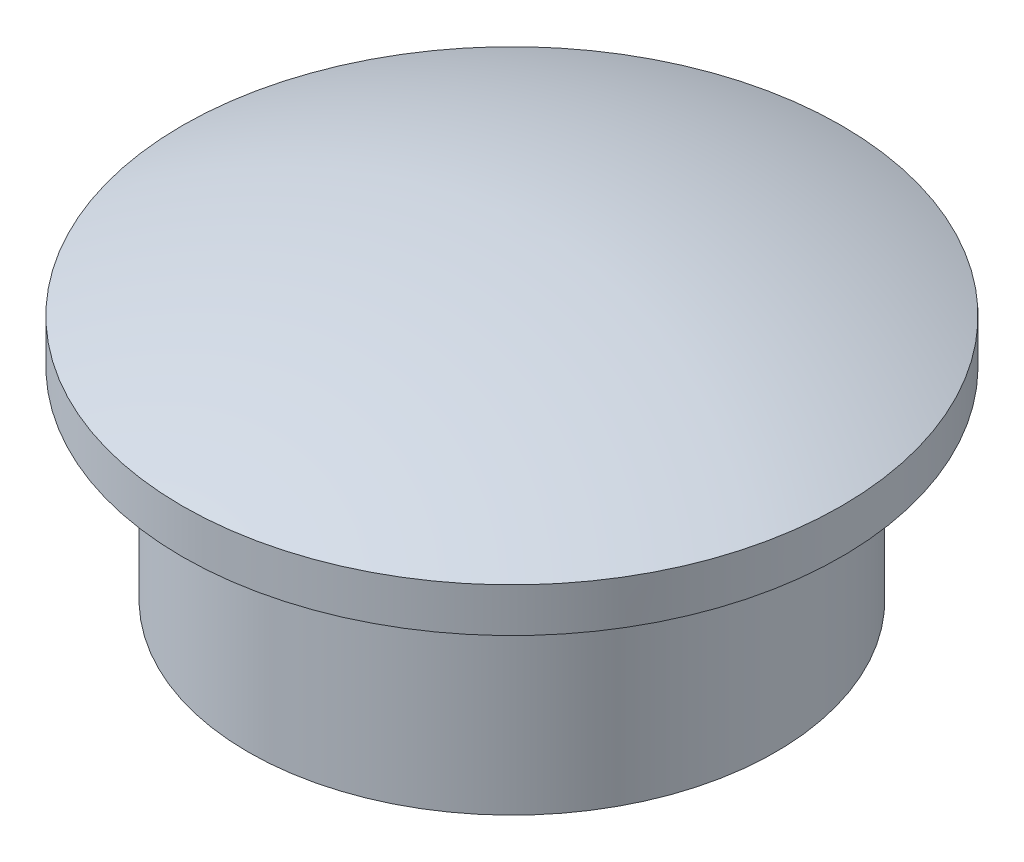
ISO-10303-21;
HEADER;
FILE_DESCRIPTION(('STEP AP214'),'2;1');
FILE_NAME('part.step','',(''),(''),'','','');
FILE_SCHEMA(('AUTOMOTIVE_DESIGN { 1 0 10303 214 1 1 1 1 }'));
ENDSEC;
DATA;
#1=APPLICATION_CONTEXT('core data for automotive mechanical design processes');
#2=APPLICATION_PROTOCOL_DEFINITION('international standard','automotive_design',2000,#1);
#3=PRODUCT_CONTEXT('',#1,'mechanical');
#4=PRODUCT('Part','Part','',(#3));
#5=PRODUCT_RELATED_PRODUCT_CATEGORY('part','',(#4));
#6=PRODUCT_DEFINITION_FORMATION('','',#4);
#7=PRODUCT_DEFINITION_CONTEXT('part definition',#1,'design');
#8=PRODUCT_DEFINITION('design','',#6,#7);
#9=PRODUCT_DEFINITION_SHAPE('','',#8);
#10=(LENGTH_UNIT() NAMED_UNIT(*) SI_UNIT(.MILLI.,.METRE.));
#11=(NAMED_UNIT(*) PLANE_ANGLE_UNIT() SI_UNIT($,.RADIAN.));
#12=(NAMED_UNIT(*) SI_UNIT($,.STERADIAN.) SOLID_ANGLE_UNIT());
#13=UNCERTAINTY_MEASURE_WITH_UNIT(LENGTH_MEASURE(1.E-05),#10,'distance_accuracy_value','');
#14=(GEOMETRIC_REPRESENTATION_CONTEXT(3) GLOBAL_UNCERTAINTY_ASSIGNED_CONTEXT((#13)) GLOBAL_UNIT_ASSIGNED_CONTEXT((#10,
#11,#12)) REPRESENTATION_CONTEXT('',''));
#15=CARTESIAN_POINT('',(0.,0.,0.));
#16=DIRECTION('',(0.,0.,1.));
#17=DIRECTION('',(1.,0.,0.));
#18=AXIS2_PLACEMENT_3D('',#15,#16,#17);
#19=CARTESIAN_POINT('',(0.,1.,0.));
#20=DIRECTION('',(0.,-1.,0.));
#21=DIRECTION('',(0.,0.,-1.));
#22=AXIS2_PLACEMENT_3D('',#19,#20,#21);
#23=CYLINDRICAL_SURFACE('',#22,7.5);
#24=CARTESIAN_POINT('',(0.,1.,0.));
#25=DIRECTION('',(0.,1.,0.));
#26=DIRECTION('',(0.,0.,1.));
#27=AXIS2_PLACEMENT_3D('',#24,#25,#26);
#28=CIRCLE('',#27,7.5);
#29=CARTESIAN_POINT('',(0.,1.,7.5));
#30=VERTEX_POINT('',#29);
#31=EDGE_CURVE('E44',#30,#30,#28,.T.);
#32=ORIENTED_EDGE('',*,*,#31,.F.);
#33=EDGE_LOOP('',(#32));
#34=FACE_BOUND('',#33,.T.);
#35=CARTESIAN_POINT('',(0.,0.,0.));
#36=DIRECTION('',(0.,1.,0.));
#37=DIRECTION('',(0.,0.,1.));
#38=AXIS2_PLACEMENT_3D('',#35,#36,#37);
#39=CIRCLE('',#38,7.5);
#40=CARTESIAN_POINT('',(0.,0.,7.5));
#41=VERTEX_POINT('',#40);
#42=EDGE_CURVE('E40',#41,#41,#39,.T.);
#43=ORIENTED_EDGE('',*,*,#42,.T.);
#44=EDGE_LOOP('',(#43));
#45=FACE_BOUND('',#44,.T.);
#46=ADVANCED_FACE('F37',(#34,#45),#23,.T.);
#47=CARTESIAN_POINT('',(0.,0.,0.));
#48=DIRECTION('',(0.,1.,0.));
#49=DIRECTION('',(0.,0.,1.));
#50=AXIS2_PLACEMENT_3D('',#47,#48,#49);
#51=PLANE('',#50);
#52=CARTESIAN_POINT('',(0.,0.,0.));
#53=DIRECTION('',(0.,-1.,0.));
#54=DIRECTION('',(0.,0.,-1.));
#55=AXIS2_PLACEMENT_3D('',#52,#53,#54);
#56=CIRCLE('',#55,6.);
#57=CARTESIAN_POINT('',(0.,0.,-6.));
#58=VERTEX_POINT('',#57);
#59=EDGE_CURVE('E10',#58,#58,#56,.T.);
#60=ORIENTED_EDGE('',*,*,#59,.F.);
#61=EDGE_LOOP('',(#60));
#62=FACE_BOUND('',#61,.T.);
#63=ORIENTED_EDGE('',*,*,#42,.F.);
#64=EDGE_LOOP('',(#63));
#65=FACE_BOUND('',#64,.T.);
#66=ADVANCED_FACE('F81',(#62,#65),#51,.F.);
#67=CARTESIAN_POINT('',(0.,-16.3701612903226,0.));
#68=DIRECTION('',(0.,1.,0.));
#69=DIRECTION('',(-1.,0.,0.));
#70=AXIS2_PLACEMENT_3D('',#67,#68,#69);
#71=SPHERICAL_SURFACE('',#70,18.9201612903226);
#72=ORIENTED_EDGE('',*,*,#31,.T.);
#73=EDGE_LOOP('',(#72));
#74=FACE_BOUND('',#73,.T.);
#75=ADVANCED_FACE('F76',(#74),#71,.T.);
#76=CARTESIAN_POINT('',(0.,-4.6,0.));
#77=DIRECTION('',(0.,1.,0.));
#78=DIRECTION('',(0.,0.,1.));
#79=AXIS2_PLACEMENT_3D('',#76,#77,#78);
#80=CYLINDRICAL_SURFACE('',#79,6.);
#81=CARTESIAN_POINT('',(0.,-4.6,0.));
#82=DIRECTION('',(0.,-1.,0.));
#83=DIRECTION('',(0.,0.,-1.));
#84=AXIS2_PLACEMENT_3D('',#81,#82,#83);
#85=CIRCLE('',#84,6.);
#86=CARTESIAN_POINT('',(0.,-4.6,-6.));
#87=VERTEX_POINT('',#86);
#88=EDGE_CURVE('E50',#87,#87,#85,.T.);
#89=ORIENTED_EDGE('',*,*,#88,.F.);
#90=EDGE_LOOP('',(#89));
#91=FACE_BOUND('',#90,.T.);
#92=ORIENTED_EDGE('',*,*,#59,.T.);
#93=EDGE_LOOP('',(#92));
#94=FACE_BOUND('',#93,.T.);
#95=ADVANCED_FACE('F71',(#91,#94),#80,.T.);
#96=CARTESIAN_POINT('',(0.,-4.6,0.));
#97=DIRECTION('',(0.,-1.,0.));
#98=DIRECTION('',(0.,0.,-1.));
#99=AXIS2_PLACEMENT_3D('',#96,#97,#98);
#100=PLANE('',#99);
#101=CARTESIAN_POINT('',(0.,-4.6,0.));
#102=DIRECTION('',(0.,-1.,0.));
#103=DIRECTION('',(0.,0.,-1.));
#104=AXIS2_PLACEMENT_3D('',#101,#102,#103);
#105=CIRCLE('',#104,4.95);
#106=CARTESIAN_POINT('',(0.,-4.6,-4.95));
#107=VERTEX_POINT('',#106);
#108=EDGE_CURVE('E54',#107,#107,#105,.T.);
#109=ORIENTED_EDGE('',*,*,#108,.F.);
#110=EDGE_LOOP('',(#109));
#111=FACE_BOUND('',#110,.T.);
#112=ORIENTED_EDGE('',*,*,#88,.T.);
#113=EDGE_LOOP('',(#112));
#114=FACE_BOUND('',#113,.T.);
#115=ADVANCED_FACE('F65',(#111,#114),#100,.T.);
#116=CARTESIAN_POINT('',(0.,1.,0.));
#117=DIRECTION('',(0.,-1.,0.));
#118=DIRECTION('',(0.,0.,-1.));
#119=AXIS2_PLACEMENT_3D('',#116,#117,#118);
#120=CYLINDRICAL_SURFACE('',#119,4.95);
#121=CARTESIAN_POINT('',(0.,1.,0.));
#122=DIRECTION('',(0.,-1.,0.));
#123=DIRECTION('',(0.,0.,-1.));
#124=AXIS2_PLACEMENT_3D('',#121,#122,#123);
#125=CIRCLE('',#124,4.95);
#126=CARTESIAN_POINT('',(0.,1.,-4.95));
#127=VERTEX_POINT('',#126);
#128=EDGE_CURVE('E53',#127,#127,#125,.T.);
#129=ORIENTED_EDGE('',*,*,#128,.F.);
#130=EDGE_LOOP('',(#129));
#131=FACE_BOUND('',#130,.T.);
#132=ORIENTED_EDGE('',*,*,#108,.T.);
#133=EDGE_LOOP('',(#132));
#134=FACE_BOUND('',#133,.T.);
#135=ADVANCED_FACE('F62',(#131,#134),#120,.F.);
#136=CARTESIAN_POINT('',(0.,1.,0.));
#137=DIRECTION('',(0.,-1.,0.));
#138=DIRECTION('',(0.,0.,-1.));
#139=AXIS2_PLACEMENT_3D('',#136,#137,#138);
#140=PLANE('',#139);
#141=ORIENTED_EDGE('',*,*,#128,.T.);
#142=EDGE_LOOP('',(#141));
#143=FACE_BOUND('',#142,.T.);
#144=ADVANCED_FACE('F60',(#143),#140,.T.);
#145=CLOSED_SHELL('',(#46,#66,#75,#95,#115,#135,#144));
#146=MANIFOLD_SOLID_BREP('B2',#145);
#147=ADVANCED_BREP_SHAPE_REPRESENTATION('',(#18,#146),#14);
#148=SHAPE_DEFINITION_REPRESENTATION(#9,#147);
ENDSEC;
END-ISO-10303-21;
